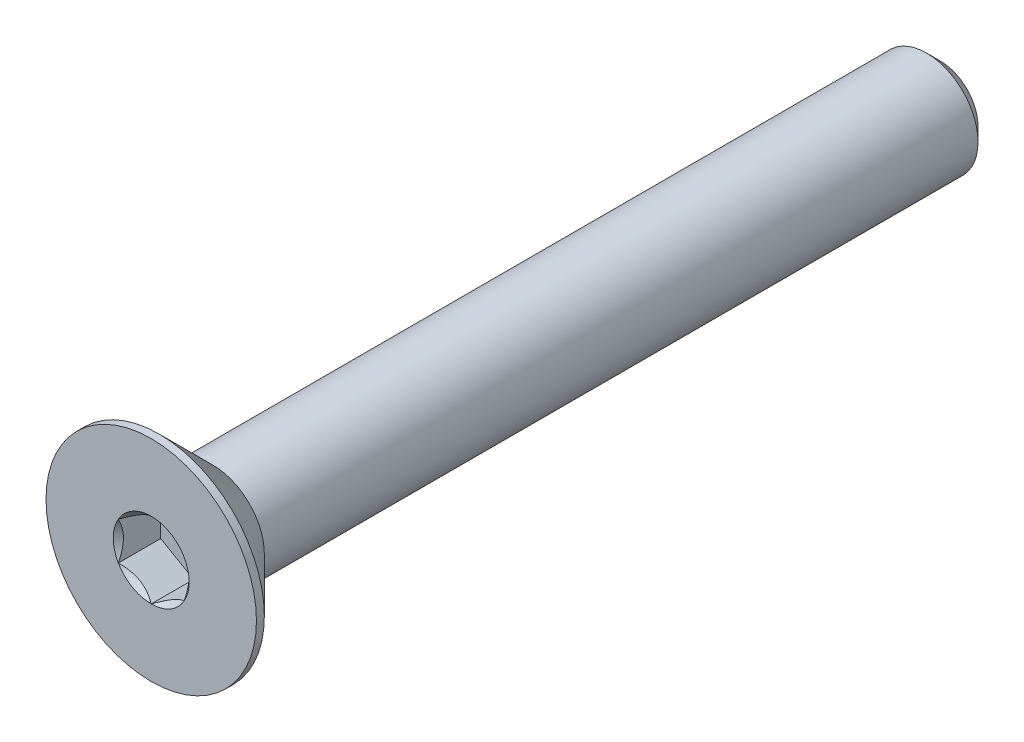
ISO-10303-21;
HEADER;
FILE_DESCRIPTION(('STEP AP214'),'2;1');
FILE_NAME('part.step','',(''),(''),'','','');
FILE_SCHEMA(('AUTOMOTIVE_DESIGN { 1 0 10303 214 1 1 1 1 }'));
ENDSEC;
DATA;
#1=APPLICATION_CONTEXT('core data for automotive mechanical design processes');
#2=APPLICATION_PROTOCOL_DEFINITION('international standard','automotive_design',2000,#1);
#3=PRODUCT_CONTEXT('',#1,'mechanical');
#4=PRODUCT('Part','Part','',(#3));
#5=PRODUCT_RELATED_PRODUCT_CATEGORY('part','',(#4));
#6=PRODUCT_DEFINITION_FORMATION('','',#4);
#7=PRODUCT_DEFINITION_CONTEXT('part definition',#1,'design');
#8=PRODUCT_DEFINITION('design','',#6,#7);
#9=PRODUCT_DEFINITION_SHAPE('','',#8);
#10=(LENGTH_UNIT() NAMED_UNIT(*) SI_UNIT(.MILLI.,.METRE.));
#11=(NAMED_UNIT(*) PLANE_ANGLE_UNIT() SI_UNIT($,.RADIAN.));
#12=(NAMED_UNIT(*) SI_UNIT($,.STERADIAN.) SOLID_ANGLE_UNIT());
#13=UNCERTAINTY_MEASURE_WITH_UNIT(LENGTH_MEASURE(1.E-05),#10,'distance_accuracy_value','');
#14=(GEOMETRIC_REPRESENTATION_CONTEXT(3) GLOBAL_UNCERTAINTY_ASSIGNED_CONTEXT((#13)) GLOBAL_UNIT_ASSIGNED_CONTEXT((#10,
#11,#12)) REPRESENTATION_CONTEXT('',''));
#15=CARTESIAN_POINT('',(0.,0.,0.));
#16=DIRECTION('',(0.,0.,1.));
#17=DIRECTION('',(1.,0.,0.));
#18=AXIS2_PLACEMENT_3D('',#15,#16,#17);
#19=CARTESIAN_POINT('',(1.25,-0.721687836487033,-1.61));
#20=DIRECTION('',(0.,0.,1.));
#21=DIRECTION('',(1.,0.,0.));
#22=AXIS2_PLACEMENT_3D('',#19,#20,#21);
#23=PLANE('',#22);
#24=DIRECTION('',(0.,1.,0.));
#25=VECTOR('',#24,1.);
#26=CARTESIAN_POINT('',(-1.25,0.721687836487033,-1.61));
#27=LINE('',#26,#25);
#28=CARTESIAN_POINT('',(-1.25,0.721687836487032,-1.61));
#29=VERTEX_POINT('',#28);
#30=CARTESIAN_POINT('',(-1.25,-0.721687836487031,-1.61));
#31=VERTEX_POINT('',#30);
#32=EDGE_CURVE('E83',#29,#31,#27,.F.);
#33=ORIENTED_EDGE('',*,*,#32,.T.);
#34=DIRECTION('',(0.866025403784439,-0.5,0.));
#35=VECTOR('',#34,1.);
#36=CARTESIAN_POINT('',(-1.25,-0.721687836487031,-1.61));
#37=LINE('',#36,#35);
#38=CARTESIAN_POINT('',(0.,-1.44337567297406,-1.61));
#39=VERTEX_POINT('',#38);
#40=EDGE_CURVE('E85',#31,#39,#37,.T.);
#41=ORIENTED_EDGE('',*,*,#40,.T.);
#42=DIRECTION('',(0.866025403784439,0.5,0.));
#43=VECTOR('',#42,1.);
#44=CARTESIAN_POINT('',(0.,-1.44337567297406,-1.61));
#45=LINE('',#44,#43);
#46=CARTESIAN_POINT('',(1.25,-0.721687836487033,-1.61));
#47=VERTEX_POINT('',#46);
#48=EDGE_CURVE('E86',#39,#47,#45,.T.);
#49=ORIENTED_EDGE('',*,*,#48,.T.);
#50=DIRECTION('',(0.,1.,0.));
#51=VECTOR('',#50,1.);
#52=CARTESIAN_POINT('',(1.25,-0.721687836487033,-1.61));
#53=LINE('',#52,#51);
#54=CARTESIAN_POINT('',(1.25,0.721687836487033,-1.61));
#55=VERTEX_POINT('',#54);
#56=EDGE_CURVE('E72',#47,#55,#53,.T.);
#57=ORIENTED_EDGE('',*,*,#56,.T.);
#58=DIRECTION('',(-0.866025403784439,0.5,0.));
#59=VECTOR('',#58,1.);
#60=CARTESIAN_POINT('',(1.25,0.721687836487033,-1.61));
#61=LINE('',#60,#59);
#62=CARTESIAN_POINT('',(0.,1.44337567297406,-1.61));
#63=VERTEX_POINT('',#62);
#64=EDGE_CURVE('E111',#55,#63,#61,.T.);
#65=ORIENTED_EDGE('',*,*,#64,.T.);
#66=DIRECTION('',(-0.866025403784439,-0.5,0.));
#67=VECTOR('',#66,1.);
#68=CARTESIAN_POINT('',(0.,1.44337567297406,-1.61));
#69=LINE('',#68,#67);
#70=EDGE_CURVE('E116',#63,#29,#69,.T.);
#71=ORIENTED_EDGE('',*,*,#70,.T.);
#72=EDGE_LOOP('',(#33,#41,#49,#57,#65,#71));
#73=FACE_BOUND('',#72,.T.);
#74=ADVANCED_FACE('F17',(#73),#23,.T.);
#75=CARTESIAN_POINT('',(0.,-1.44337567297406,-1.61));
#76=DIRECTION('',(0.5,-0.866025403784439,0.));
#77=DIRECTION('',(0.866025403784439,0.5,0.));
#78=AXIS2_PLACEMENT_3D('',#75,#76,#77);
#79=PLANE('',#78);
#80=CARTESIAN_POINT('',(-1.59633159146153E-12,-1.44337567297499,-2.268582549399E-12));
#81=CARTESIAN_POINT('',(0.0429631084916685,-1.41857091072118,-0.0247809602853262));
#82=CARTESIAN_POINT('',(0.0866445640224962,-1.39335141061186,-0.048106250542211));
#83=CARTESIAN_POINT('',(0.175715534518587,-1.34192626181896,-0.0908138610995848));
#84=CARTESIAN_POINT('',(0.221113515509129,-1.3157157252734,-0.110172426663462));
#85=CARTESIAN_POINT('',(0.312656311401012,-1.26286346742285,-0.143333784117164));
#86=CARTESIAN_POINT('',(0.358777825771211,-1.23623519868579,-0.15721990325138));
#87=CARTESIAN_POINT('',(0.452035961001519,-1.18239258920645,-0.178614098245694));
#88=CARTESIAN_POINT('',(0.499169734949581,-1.15517989212961,-0.186138138130082));
#89=CARTESIAN_POINT('',(0.580409086338886,-1.1082763307362,-0.192927172266352));
#90=CARTESIAN_POINT('',(0.6144098218632,-1.0886459969286,-0.19393181141306));
#91=CARTESIAN_POINT('',(0.682351445146423,-1.04941988243685,-0.192236504858619));
#92=CARTESIAN_POINT('',(0.716292318027035,-1.02982411034269,-0.189535740825175));
#93=CARTESIAN_POINT('',(0.783846380048843,-0.990821754449551,-0.180585751756811));
#94=CARTESIAN_POINT('',(0.817459234875116,-0.97141536366737,-0.174333227052609));
#95=CARTESIAN_POINT('',(0.884123738991266,-0.932926594270518,-0.158616460881214));
#96=CARTESIAN_POINT('',(0.917175141068937,-0.91384435838388,-0.149150841277129));
#97=CARTESIAN_POINT('',(1.00178642984031,-0.864994008035248,-0.121071668556236));
#98=CARTESIAN_POINT('',(1.05281387539248,-0.835533298609642,-0.100350655055702));
#99=CARTESIAN_POINT('',(1.15287239429478,-0.777764485786684,-0.0536764942537954));
#100=CARTESIAN_POINT('',(1.20190935742265,-0.749452981924566,-0.0277403788128118));
#101=CARTESIAN_POINT('',(1.25000000000159,-0.721687836486111,-2.26874925040989E-12));
#102=B_SPLINE_CURVE_WITH_KNOTS('',3,(#80,#81,#82,#83,#84,#85,#86,#87,#88,#89,#90,#91,#92,#93,
#94,#95,#96,#97,#98,#99,#100,#101),.UNSPECIFIED.,.F.,.F.,(4,2,2,2,2,2,2,2,2,2,4),(0.,
0.166478683193945,0.333926926769032,0.498716658424013,0.663091654503517,0.780745575390526,
0.89842548413854,1.01621489951224,1.13405490022132,1.32111591628309,1.5075756576265),.UNSPECIFIED.);
#103=CARTESIAN_POINT('',(0.,-1.44337567297566,-1.5951974611112E-12));
#104=VERTEX_POINT('',#103);
#105=CARTESIAN_POINT('',(1.2500000000008,-0.721687836489762,-1.13440319504478E-12));
#106=VERTEX_POINT('',#105);
#107=EDGE_CURVE('E20',#104,#106,#102,.T.);
#108=ORIENTED_EDGE('',*,*,#107,.T.);
#109=DIRECTION('',(0.,0.,1.));
#110=VECTOR('',#109,1.);
#111=CARTESIAN_POINT('',(1.25,-0.721687836487033,-1.61));
#112=LINE('',#111,#110);
#113=EDGE_CURVE('E91',#106,#47,#112,.F.);
#114=ORIENTED_EDGE('',*,*,#113,.T.);
#115=ORIENTED_EDGE('',*,*,#48,.F.);
#116=DIRECTION('',(0.,0.,1.));
#117=VECTOR('',#116,1.);
#118=CARTESIAN_POINT('',(0.,-1.44337567297406,-1.61));
#119=LINE('',#118,#117);
#120=EDGE_CURVE('E59',#39,#104,#119,.T.);
#121=ORIENTED_EDGE('',*,*,#120,.T.);
#122=EDGE_LOOP('',(#108,#114,#115,#121));
#123=FACE_BOUND('',#122,.T.);
#124=ADVANCED_FACE('F90',(#123),#79,.F.);
#125=CARTESIAN_POINT('',(-1.25,-0.721687836487031,-1.61));
#126=DIRECTION('',(-0.5,-0.866025403784439,0.));
#127=DIRECTION('',(0.866025403784439,-0.5,0.));
#128=AXIS2_PLACEMENT_3D('',#125,#126,#127);
#129=PLANE('',#128);
#130=CARTESIAN_POINT('',(-1.2500000000016,-0.721687836486109,-2.26772727717919E-12));
#131=CARTESIAN_POINT('',(-1.20703689150833,-0.746492598739919,-0.0247809602853254));
#132=CARTESIAN_POINT('',(-1.1633554359775,-0.771712098849237,-0.0481062505422104));
#133=CARTESIAN_POINT('',(-1.07428446548141,-0.823137247642137,-0.0908138610995846));
#134=CARTESIAN_POINT('',(-1.02888648449087,-0.849347784187692,-0.110172426663462));
#135=CARTESIAN_POINT('',(-0.937343688598988,-0.902200042038241,-0.143333784117165));
#136=CARTESIAN_POINT('',(-0.891222174228788,-0.928828310775309,-0.15721990325138));
#137=CARTESIAN_POINT('',(-0.79796403899848,-0.98267092025465,-0.178614098245695));
#138=CARTESIAN_POINT('',(-0.750830265050418,-1.00988361733149,-0.186138138130082));
#139=CARTESIAN_POINT('',(-0.669590913661113,-1.05678717872489,-0.192927172266352));
#140=CARTESIAN_POINT('',(-0.635590178136799,-1.0764175125325,-0.193931811413061));
#141=CARTESIAN_POINT('',(-0.567648554853576,-1.11564362702425,-0.192236504858619));
#142=CARTESIAN_POINT('',(-0.533707681972964,-1.1352393991184,-0.189535740825175));
#143=CARTESIAN_POINT('',(-0.466153619951155,-1.17424175501155,-0.180585751756811));
#144=CARTESIAN_POINT('',(-0.432540765124883,-1.19364814579373,-0.174333227052609));
#145=CARTESIAN_POINT('',(-0.365876261008733,-1.23213691519058,-0.158616460881214));
#146=CARTESIAN_POINT('',(-0.332824858931062,-1.25121915107722,-0.149150841277129));
#147=CARTESIAN_POINT('',(-0.248213570159689,-1.30006950142585,-0.121071668556236));
#148=CARTESIAN_POINT('',(-0.197186124607517,-1.32953021085146,-0.100350655055702));
#149=CARTESIAN_POINT('',(-0.0971276057052169,-1.38729902367441,-0.0536764942537953));
#150=CARTESIAN_POINT('',(-0.0480906425773456,-1.41561052753653,-0.0277403788128117));
#151=CARTESIAN_POINT('',(1.59649182397064E-12,-1.44337567297499,-2.26862875383583E-12));
#152=B_SPLINE_CURVE_WITH_KNOTS('',3,(#130,#131,#132,#133,#134,#135,#136,#137,#138,#139,#140,
#141,#142,#143,#144,#145,#146,#147,#148,#149,#150,#151),.UNSPECIFIED.,.F.,.F.,(4,2,2,2,2,2,2,2,
2,2,4),(0.,0.166478683193946,0.333926926769033,0.498716658424015,0.66309165450352,
0.780745575390529,0.898425484138542,1.01621489951224,1.13405490022132,1.3211159162831,
1.5075756576265),.UNSPECIFIED.);
#153=CARTESIAN_POINT('',(-1.25000000000138,-0.721687836487828,-1.59464569232191E-12));
#154=VERTEX_POINT('',#153);
#155=EDGE_CURVE('E95',#154,#104,#152,.T.);
#156=ORIENTED_EDGE('',*,*,#155,.T.);
#157=ORIENTED_EDGE('',*,*,#120,.F.);
#158=ORIENTED_EDGE('',*,*,#40,.F.);
#159=DIRECTION('',(0.,0.,1.));
#160=VECTOR('',#159,1.);
#161=CARTESIAN_POINT('',(-1.25,-0.721687836487031,-1.61));
#162=LINE('',#161,#160);
#163=EDGE_CURVE('E97',#31,#154,#162,.T.);
#164=ORIENTED_EDGE('',*,*,#163,.T.);
#165=EDGE_LOOP('',(#156,#157,#158,#164));
#166=FACE_BOUND('',#165,.T.);
#167=ADVANCED_FACE('F93',(#166),#129,.F.);
#168=CARTESIAN_POINT('',(-1.25,0.721687836487033,-1.61));
#169=DIRECTION('',(-1.,0.,0.));
#170=DIRECTION('',(0.,0.,1.));
#171=AXIS2_PLACEMENT_3D('',#168,#169,#170);
#172=PLANE('',#171);
#173=CARTESIAN_POINT('',(-1.25,0.721687836488875,-2.26707172904113E-12));
#174=CARTESIAN_POINT('',(-1.25,0.672078311968734,-0.0247809602843515));
#175=CARTESIAN_POINT('',(-1.25,0.621639311737501,-0.0481062505397474));
#176=CARTESIAN_POINT('',(-1.25,0.518789014126518,-0.0908138610927559));
#177=CARTESIAN_POINT('',(-1.25,0.466367941022824,-0.110172426653753));
#178=CARTESIAN_POINT('',(-1.25,0.360663425297221,-0.143333784099995));
#179=CARTESIAN_POINT('',(-1.25,0.307406887811172,-0.157219903229681));
#180=CARTESIAN_POINT('',(-1.25,0.199721668829271,-0.178614098213361));
#181=CARTESIAN_POINT('',(-1.25,0.145296274664291,-0.186138138091645));
#182=CARTESIAN_POINT('',(-1.25,0.0514891518512712,-0.192927172217058));
#183=CARTESIAN_POINT('',(-1.25,0.0122284842208852,-0.19393181135857));
#184=CARTESIAN_POINT('',(-1.25,-0.0662237447923836,-0.19223650479206));
#185=CARTESIAN_POINT('',(-1.25,-0.10541528899529,-0.189535740751741));
#186=CARTESIAN_POINT('',(-1.25,-0.183420000810115,-0.180585751668415));
#187=CARTESIAN_POINT('',(-1.25,-0.222232782388411,-0.174333226956124));
#188=CARTESIAN_POINT('',(-1.25,-0.299210321209361,-0.158616460767832));
#189=CARTESIAN_POINT('',(-1.25,-0.337374792995946,-0.14915084115494));
#190=CARTESIAN_POINT('',(-1.25,-0.43507549364919,-0.121071668433227));
#191=CARTESIAN_POINT('',(-1.25,-0.493996912445358,-0.100350654949517));
#192=CARTESIAN_POINT('',(-1.25,-0.609534537985813,-0.0536764941931683));
#193=CARTESIAN_POINT('',(-1.25,-0.66615754565963,-0.0277403787809137));
#194=CARTESIAN_POINT('',(-1.25,-0.721687836488873,-2.26787846144495E-12));
#195=B_SPLINE_CURVE_WITH_KNOTS('',3,(#173,#174,#175,#176,#177,#178,#179,#180,#181,#182,#183,
#184,#185,#186,#187,#188,#189,#190,#191,#192,#193,#194),.UNSPECIFIED.,.F.,.F.,(4,2,2,2,2,2,2,2,
2,2,4),(0.,0.166478683226287,0.333926926833723,0.498716658519756,0.663091654630285,
0.780745575562284,0.89842548435534,1.01621489977414,1.13405490052833,1.3211159164188,
1.50757565759031),.UNSPECIFIED.);
#196=CARTESIAN_POINT('',(-1.25000000000138,0.72168783648783,-1.59446391689966E-12));
#197=VERTEX_POINT('',#196);
#198=EDGE_CURVE('E195',#197,#154,#195,.T.);
#199=ORIENTED_EDGE('',*,*,#198,.T.);
#200=ORIENTED_EDGE('',*,*,#163,.F.);
#201=ORIENTED_EDGE('',*,*,#32,.F.);
#202=DIRECTION('',(0.,0.,1.));
#203=VECTOR('',#202,1.);
#204=CARTESIAN_POINT('',(-1.25,0.721687836487032,-1.61));
#205=LINE('',#204,#203);
#206=EDGE_CURVE('E113',#29,#197,#205,.T.);
#207=ORIENTED_EDGE('',*,*,#206,.T.);
#208=EDGE_LOOP('',(#199,#200,#201,#207));
#209=FACE_BOUND('',#208,.T.);
#210=ADVANCED_FACE('F205',(#209),#172,.F.);
#211=CARTESIAN_POINT('',(0.,1.44337567297406,-1.61));
#212=DIRECTION('',(-0.5,0.866025403784439,0.));
#213=DIRECTION('',(-0.866025403784439,-0.5,0.));
#214=AXIS2_PLACEMENT_3D('',#211,#212,#213);
#215=PLANE('',#214);
#216=CARTESIAN_POINT('',(1.59613349239709E-12,1.44337567297499,-2.2683395990387E-12));
#217=CARTESIAN_POINT('',(-0.0429631084916687,1.41857091072118,-0.024780960285326));
#218=CARTESIAN_POINT('',(-0.0866445640224964,1.39335141061186,-0.0481062505422108));
#219=CARTESIAN_POINT('',(-0.175715534518587,1.34192626181896,-0.0908138610995847));
#220=CARTESIAN_POINT('',(-0.22111351550913,1.3157157252734,-0.110172426663462));
#221=CARTESIAN_POINT('',(-0.312656311401012,1.26286346742285,-0.143333784117164));
#222=CARTESIAN_POINT('',(-0.358777825771212,1.23623519868579,-0.15721990325138));
#223=CARTESIAN_POINT('',(-0.45203596100152,1.18239258920645,-0.178614098245694));
#224=CARTESIAN_POINT('',(-0.499169734949581,1.15517989212961,-0.186138138130082));
#225=CARTESIAN_POINT('',(-0.580409086338886,1.1082763307362,-0.192927172266352));
#226=CARTESIAN_POINT('',(-0.6144098218632,1.0886459969286,-0.19393181141306));
#227=CARTESIAN_POINT('',(-0.682351445146423,1.04941988243685,-0.192236504858619));
#228=CARTESIAN_POINT('',(-0.716292318027036,1.02982411034269,-0.189535740825175));
#229=CARTESIAN_POINT('',(-0.783846380048844,0.99082175444955,-0.180585751756811));
#230=CARTESIAN_POINT('',(-0.817459234875117,0.97141536366737,-0.174333227052609));
#231=CARTESIAN_POINT('',(-0.884123738991267,0.932926594270518,-0.158616460881213));
#232=CARTESIAN_POINT('',(-0.917175141068938,0.91384435838388,-0.149150841277128));
#233=CARTESIAN_POINT('',(-1.00178642984031,0.864994008035247,-0.121071668556235));
#234=CARTESIAN_POINT('',(-1.05281387539248,0.835533298609641,-0.100350655055701));
#235=CARTESIAN_POINT('',(-1.15287239429478,0.777764485786683,-0.0536764942537944));
#236=CARTESIAN_POINT('',(-1.20190935742265,0.749452981924565,-0.0277403788128108));
#237=CARTESIAN_POINT('',(-1.2500000000016,0.721687836486111,-2.26788103424833E-12));
#238=B_SPLINE_CURVE_WITH_KNOTS('',3,(#216,#217,#218,#219,#220,#221,#222,#223,#224,#225,#226,
#227,#228,#229,#230,#231,#232,#233,#234,#235,#236,#237),.UNSPECIFIED.,.F.,.F.,(4,2,2,2,2,2,2,2,
2,2,4),(0.,0.166478683193945,0.333926926769032,0.498716658424013,0.663091654503518,
0.780745575390527,0.898425484138541,1.01621489951224,1.13405490022132,1.3211159162831,
1.5075756576265),.UNSPECIFIED.);
#239=CARTESIAN_POINT('',(0.,1.44337567297566,-1.59483068508603E-12));
#240=VERTEX_POINT('',#239);
#241=EDGE_CURVE('E187',#240,#197,#238,.T.);
#242=ORIENTED_EDGE('',*,*,#241,.T.);
#243=ORIENTED_EDGE('',*,*,#206,.F.);
#244=ORIENTED_EDGE('',*,*,#70,.F.);
#245=DIRECTION('',(0.,0.,1.));
#246=VECTOR('',#245,1.);
#247=CARTESIAN_POINT('',(0.,1.44337567297406,-1.61));
#248=LINE('',#247,#246);
#249=EDGE_CURVE('E108',#63,#240,#248,.T.);
#250=ORIENTED_EDGE('',*,*,#249,.T.);
#251=EDGE_LOOP('',(#242,#243,#244,#250));
#252=FACE_BOUND('',#251,.T.);
#253=ADVANCED_FACE('F201',(#252),#215,.F.);
#254=CARTESIAN_POINT('',(1.25,0.721687836487033,-1.61));
#255=DIRECTION('',(0.5,0.866025403784439,0.));
#256=DIRECTION('',(-0.866025403784439,0.5,0.));
#257=AXIS2_PLACEMENT_3D('',#254,#255,#256);
#258=PLANE('',#257);
#259=CARTESIAN_POINT('',(1.2500000000016,0.721687836486112,-2.26853678419014E-12));
#260=CARTESIAN_POINT('',(1.20703689150833,0.746492598739921,-0.0247809602853261));
#261=CARTESIAN_POINT('',(1.1633554359775,0.771712098849239,-0.0481062505422108));
#262=CARTESIAN_POINT('',(1.07428446548141,0.823137247642138,-0.0908138610995846));
#263=CARTESIAN_POINT('',(1.02888648449087,0.849347784187693,-0.110172426663462));
#264=CARTESIAN_POINT('',(0.937343688598987,0.902200042038243,-0.143333784117164));
#265=CARTESIAN_POINT('',(0.891222174228788,0.92882831077531,-0.15721990325138));
#266=CARTESIAN_POINT('',(0.79796403899848,0.982670920254651,-0.178614098245694));
#267=CARTESIAN_POINT('',(0.750830265050419,1.00988361733149,-0.186138138130081));
#268=CARTESIAN_POINT('',(0.669590913661114,1.05678717872489,-0.192927172266351));
#269=CARTESIAN_POINT('',(0.6355901781368,1.0764175125325,-0.19393181141306));
#270=CARTESIAN_POINT('',(0.567648554853577,1.11564362702425,-0.192236504858619));
#271=CARTESIAN_POINT('',(0.533707681972964,1.1352393991184,-0.189535740825174));
#272=CARTESIAN_POINT('',(0.466153619951156,1.17424175501155,-0.180585751756811));
#273=CARTESIAN_POINT('',(0.432540765124883,1.19364814579373,-0.174333227052609));
#274=CARTESIAN_POINT('',(0.365876261008733,1.23213691519058,-0.158616460881213));
#275=CARTESIAN_POINT('',(0.332824858931062,1.25121915107722,-0.149150841277128));
#276=CARTESIAN_POINT('',(0.24821357015969,1.30006950142585,-0.121071668556235));
#277=CARTESIAN_POINT('',(0.197186124607517,1.32953021085146,-0.100350655055702));
#278=CARTESIAN_POINT('',(0.0971276057052174,1.38729902367441,-0.0536764942537946));
#279=CARTESIAN_POINT('',(0.0480906425773461,1.41561052753653,-0.0277403788128111));
#280=CARTESIAN_POINT('',(-1.59614565415006E-12,1.44337567297499,-2.26815881940463E-12));
#281=B_SPLINE_CURVE_WITH_KNOTS('',3,(#259,#260,#261,#262,#263,#264,#265,#266,#267,#268,#269,
#270,#271,#272,#273,#274,#275,#276,#277,#278,#279,#280),.UNSPECIFIED.,.F.,.F.,(4,2,2,2,2,2,2,2,
2,2,4),(0.,0.166478683193945,0.333926926769031,0.498716658424013,0.663091654503516,
0.780745575390525,0.898425484138539,1.01621489951224,1.13405490022132,1.32111591628309,
1.5075756576265),.UNSPECIFIED.);
#282=CARTESIAN_POINT('',(1.25000000000138,0.721687836487831,-1.59505075853978E-12));
#283=VERTEX_POINT('',#282);
#284=EDGE_CURVE('E157',#283,#240,#281,.T.);
#285=ORIENTED_EDGE('',*,*,#284,.T.);
#286=ORIENTED_EDGE('',*,*,#249,.F.);
#287=ORIENTED_EDGE('',*,*,#64,.F.);
#288=DIRECTION('',(0.,0.,1.));
#289=VECTOR('',#288,1.);
#290=CARTESIAN_POINT('',(1.25,0.721687836487033,-1.61));
#291=LINE('',#290,#289);
#292=EDGE_CURVE('E40',#55,#283,#291,.T.);
#293=ORIENTED_EDGE('',*,*,#292,.T.);
#294=EDGE_LOOP('',(#285,#286,#287,#293));
#295=FACE_BOUND('',#294,.T.);
#296=ADVANCED_FACE('F204',(#295),#258,.F.);
#297=CARTESIAN_POINT('',(1.25,-0.721687836487033,-1.61));
#298=DIRECTION('',(1.,0.,0.));
#299=DIRECTION('',(0.,1.,0.));
#300=AXIS2_PLACEMENT_3D('',#297,#298,#299);
#301=PLANE('',#300);
#302=CARTESIAN_POINT('',(1.25,-0.721687836488877,-2.26868277257188E-12));
#303=CARTESIAN_POINT('',(1.25,-0.672078311968736,-0.0247809602843532));
#304=CARTESIAN_POINT('',(1.25,-0.621639311737502,-0.0481062505397492));
#305=CARTESIAN_POINT('',(1.25,-0.51878901412652,-0.0908138610927579));
#306=CARTESIAN_POINT('',(1.25,-0.466367941022825,-0.110172426653756));
#307=CARTESIAN_POINT('',(1.25,-0.360663425297223,-0.143333784099998));
#308=CARTESIAN_POINT('',(1.25,-0.307406887811173,-0.157219903229684));
#309=CARTESIAN_POINT('',(1.25,-0.199721668829271,-0.178614098213363));
#310=CARTESIAN_POINT('',(1.25,-0.145296274664292,-0.186138138091648));
#311=CARTESIAN_POINT('',(1.25,-0.0514891518512717,-0.19292717221706));
#312=CARTESIAN_POINT('',(1.25,-0.0122284842208858,-0.193931811358573));
#313=CARTESIAN_POINT('',(1.25,0.0662237447923829,-0.192236504792063));
#314=CARTESIAN_POINT('',(1.25,0.105415288995289,-0.189535740751744));
#315=CARTESIAN_POINT('',(1.25,0.183420000810114,-0.180585751668418));
#316=CARTESIAN_POINT('',(1.25,0.22223278238841,-0.174333226956126));
#317=CARTESIAN_POINT('',(1.25,0.299210321209359,-0.158616460767835));
#318=CARTESIAN_POINT('',(1.25,0.337374792995945,-0.149150841154943));
#319=CARTESIAN_POINT('',(1.25,0.43507549364919,-0.121071668433229));
#320=CARTESIAN_POINT('',(1.25,0.493996912445358,-0.100350654949519));
#321=CARTESIAN_POINT('',(1.25,0.609534537985814,-0.0536764941931697));
#322=CARTESIAN_POINT('',(1.25,0.666157545659632,-0.0277403787809148));
#323=CARTESIAN_POINT('',(1.25,0.721687836488876,-2.26852812832509E-12));
#324=B_SPLINE_CURVE_WITH_KNOTS('',3,(#302,#303,#304,#305,#306,#307,#308,#309,#310,#311,#312,
#313,#314,#315,#316,#317,#318,#319,#320,#321,#322,#323),.UNSPECIFIED.,.F.,.F.,(4,2,2,2,2,2,2,2,
2,2,4),(0.,0.166478683226287,0.333926926833724,0.498716658519757,0.663091654630287,
0.780745575562285,0.898425484355342,1.01621489977414,1.13405490052833,1.3211159164188,
1.50757565759032),.UNSPECIFIED.);
#325=EDGE_CURVE('E149',#106,#283,#324,.T.);
#326=ORIENTED_EDGE('',*,*,#325,.T.);
#327=ORIENTED_EDGE('',*,*,#292,.F.);
#328=ORIENTED_EDGE('',*,*,#56,.F.);
#329=ORIENTED_EDGE('',*,*,#113,.F.);
#330=EDGE_LOOP('',(#326,#327,#328,#329));
#331=FACE_BOUND('',#330,.T.);
#332=ADVANCED_FACE('F165',(#331),#301,.F.);
#333=CARTESIAN_POINT('',(0.,0.,-5.6843418860808E-11));
#334=DIRECTION('',(0.,0.,1.));
#335=DIRECTION('',(1.,0.,0.));
#336=AXIS2_PLACEMENT_3D('',#333,#334,#335);
#337=CONICAL_SURFACE('',#336,1.44337567292041,0.78539816325135);
#338=ORIENTED_EDGE('',*,*,#107,.F.);
#339=CARTESIAN_POINT('',(0.,0.,0.));
#340=DIRECTION('',(0.,0.,1.));
#341=DIRECTION('',(1.,0.,0.));
#342=AXIS2_PLACEMENT_3D('',#339,#340,#341);
#343=CIRCLE('',#342,1.44337567297725);
#344=EDGE_CURVE('E146',#106,#104,#343,.F.);
#345=ORIENTED_EDGE('',*,*,#344,.F.);
#346=EDGE_LOOP('',(#338,#345));
#347=FACE_BOUND('',#346,.T.);
#348=ADVANCED_FACE('F222',(#347),#337,.F.);
#349=CARTESIAN_POINT('',(0.,0.,-5.6843418860808E-11));
#350=DIRECTION('',(0.,0.,1.));
#351=DIRECTION('',(1.,0.,0.));
#352=AXIS2_PLACEMENT_3D('',#349,#350,#351);
#353=CONICAL_SURFACE('',#352,1.44337567292041,0.78539816325135);
#354=ORIENTED_EDGE('',*,*,#155,.F.);
#355=CARTESIAN_POINT('',(0.,0.,0.));
#356=DIRECTION('',(0.,0.,1.));
#357=DIRECTION('',(1.,0.,0.));
#358=AXIS2_PLACEMENT_3D('',#355,#356,#357);
#359=CIRCLE('',#358,1.44337567297725);
#360=EDGE_CURVE('E143',#104,#154,#359,.F.);
#361=ORIENTED_EDGE('',*,*,#360,.F.);
#362=EDGE_LOOP('',(#354,#361));
#363=FACE_BOUND('',#362,.T.);
#364=ADVANCED_FACE('F219',(#363),#353,.F.);
#365=CARTESIAN_POINT('',(0.,0.,-5.6843418860808E-11));
#366=DIRECTION('',(0.,0.,1.));
#367=DIRECTION('',(1.,0.,0.));
#368=AXIS2_PLACEMENT_3D('',#365,#366,#367);
#369=CONICAL_SURFACE('',#368,1.44337567292041,0.785398163397448);
#370=ORIENTED_EDGE('',*,*,#198,.F.);
#371=CARTESIAN_POINT('',(0.,0.,0.));
#372=DIRECTION('',(0.,0.,1.));
#373=DIRECTION('',(1.,0.,0.));
#374=AXIS2_PLACEMENT_3D('',#371,#372,#373);
#375=CIRCLE('',#374,1.44337567297725);
#376=EDGE_CURVE('E140',#154,#197,#375,.F.);
#377=ORIENTED_EDGE('',*,*,#376,.F.);
#378=EDGE_LOOP('',(#370,#377));
#379=FACE_BOUND('',#378,.T.);
#380=ADVANCED_FACE('F183',(#379),#369,.F.);
#381=CARTESIAN_POINT('',(0.,0.,-5.6843418860808E-11));
#382=DIRECTION('',(0.,0.,1.));
#383=DIRECTION('',(1.,0.,0.));
#384=AXIS2_PLACEMENT_3D('',#381,#382,#383);
#385=CONICAL_SURFACE('',#384,1.44337567292041,0.78539816325135);
#386=ORIENTED_EDGE('',*,*,#241,.F.);
#387=CARTESIAN_POINT('',(0.,0.,0.));
#388=DIRECTION('',(0.,0.,1.));
#389=DIRECTION('',(1.,0.,0.));
#390=AXIS2_PLACEMENT_3D('',#387,#388,#389);
#391=CIRCLE('',#390,1.44337567297725);
#392=EDGE_CURVE('E137',#197,#240,#391,.F.);
#393=ORIENTED_EDGE('',*,*,#392,.F.);
#394=EDGE_LOOP('',(#386,#393));
#395=FACE_BOUND('',#394,.T.);
#396=ADVANCED_FACE('F178',(#395),#385,.F.);
#397=CARTESIAN_POINT('',(0.,0.,-5.6843418860808E-11));
#398=DIRECTION('',(0.,0.,1.));
#399=DIRECTION('',(1.,0.,0.));
#400=AXIS2_PLACEMENT_3D('',#397,#398,#399);
#401=CONICAL_SURFACE('',#400,1.44337567292041,0.78539816325135);
#402=ORIENTED_EDGE('',*,*,#284,.F.);
#403=CARTESIAN_POINT('',(0.,0.,0.));
#404=DIRECTION('',(0.,0.,1.));
#405=DIRECTION('',(1.,0.,0.));
#406=AXIS2_PLACEMENT_3D('',#403,#404,#405);
#407=CIRCLE('',#406,1.44337567297725);
#408=EDGE_CURVE('E134',#240,#283,#407,.F.);
#409=ORIENTED_EDGE('',*,*,#408,.F.);
#410=EDGE_LOOP('',(#402,#409));
#411=FACE_BOUND('',#410,.T.);
#412=ADVANCED_FACE('F172',(#411),#401,.F.);
#413=CARTESIAN_POINT('',(0.,0.,-5.6843418860808E-11));
#414=DIRECTION('',(0.,0.,1.));
#415=DIRECTION('',(1.,0.,0.));
#416=AXIS2_PLACEMENT_3D('',#413,#414,#415);
#417=CONICAL_SURFACE('',#416,1.44337567292041,0.785398163397448);
#418=CARTESIAN_POINT('',(0.,0.,0.));
#419=DIRECTION('',(0.,0.,1.));
#420=DIRECTION('',(1.,0.,0.));
#421=AXIS2_PLACEMENT_3D('',#418,#419,#420);
#422=CIRCLE('',#421,1.44337567297725);
#423=EDGE_CURVE('E131',#283,#106,#422,.F.);
#424=ORIENTED_EDGE('',*,*,#423,.F.);
#425=ORIENTED_EDGE('',*,*,#325,.F.);
#426=EDGE_LOOP('',(#424,#425));
#427=FACE_BOUND('',#426,.T.);
#428=ADVANCED_FACE('F167',(#427),#417,.F.);
#429=CARTESIAN_POINT('',(0.,-2.,0.));
#430=DIRECTION('',(0.,0.,1.));
#431=DIRECTION('',(0.,-1.,0.));
#432=AXIS2_PLACEMENT_3D('',#429,#430,#431);
#433=PLANE('',#432);
#434=ORIENTED_EDGE('',*,*,#408,.T.);
#435=ORIENTED_EDGE('',*,*,#423,.T.);
#436=ORIENTED_EDGE('',*,*,#344,.T.);
#437=ORIENTED_EDGE('',*,*,#360,.T.);
#438=ORIENTED_EDGE('',*,*,#376,.T.);
#439=ORIENTED_EDGE('',*,*,#392,.T.);
#440=EDGE_LOOP('',(#434,#435,#436,#437,#438,#439));
#441=FACE_BOUND('',#440,.T.);
#442=CARTESIAN_POINT('',(0.,0.,0.));
#443=DIRECTION('',(0.,0.,1.));
#444=DIRECTION('',(0.,-1.,0.));
#445=AXIS2_PLACEMENT_3D('',#442,#443,#444);
#446=CIRCLE('',#445,4.);
#447=CARTESIAN_POINT('',(0.,-4.,0.));
#448=VERTEX_POINT('',#447);
#449=EDGE_CURVE('E128',#448,#448,#446,.F.);
#450=ORIENTED_EDGE('',*,*,#449,.F.);
#451=EDGE_LOOP('',(#450));
#452=FACE_BOUND('',#451,.T.);
#453=ADVANCED_FACE('F171',(#441,#452),#433,.T.);
#454=CARTESIAN_POINT('',(0.,-2.,-29.9999999999999));
#455=DIRECTION('',(0.,0.,-1.));
#456=DIRECTION('',(0.,1.,0.));
#457=AXIS2_PLACEMENT_3D('',#454,#455,#456);
#458=PLANE('',#457);
#459=CARTESIAN_POINT('',(0.,0.,-30.0000000000296));
#460=DIRECTION('',(0.,0.,1.));
#461=DIRECTION('',(1.,0.,0.));
#462=AXIS2_PLACEMENT_3D('',#459,#460,#461);
#463=CIRCLE('',#462,1.42899999997326);
#464=CARTESIAN_POINT('',(1.42899999997326,0.,-30.0000000000296));
#465=VERTEX_POINT('',#464);
#466=EDGE_CURVE('E124',#465,#465,#463,.T.);
#467=ORIENTED_EDGE('',*,*,#466,.F.);
#468=EDGE_LOOP('',(#467));
#469=FACE_BOUND('',#468,.T.);
#470=ADVANCED_FACE('F250',(#469),#458,.T.);
#471=CARTESIAN_POINT('',(0.,0.,0.));
#472=DIRECTION('',(0.,0.,1.));
#473=DIRECTION('',(0.,-1.,0.));
#474=AXIS2_PLACEMENT_3D('',#471,#472,#473);
#475=CYLINDRICAL_SURFACE('',#474,4.);
#476=CARTESIAN_POINT('',(0.,0.,-0.299999999981541));
#477=DIRECTION('',(0.,0.,1.));
#478=DIRECTION('',(0.,-1.,0.));
#479=AXIS2_PLACEMENT_3D('',#476,#477,#478);
#480=CIRCLE('',#479,4.0000000000191);
#481=CARTESIAN_POINT('',(0.,-4.0000000000191,-0.299999999981537));
#482=VERTEX_POINT('',#481);
#483=EDGE_CURVE('E127',#482,#482,#480,.F.);
#484=ORIENTED_EDGE('',*,*,#483,.F.);
#485=EDGE_LOOP('',(#484));
#486=FACE_BOUND('',#485,.T.);
#487=ORIENTED_EDGE('',*,*,#449,.T.);
#488=EDGE_LOOP('',(#487));
#489=FACE_BOUND('',#488,.T.);
#490=ADVANCED_FACE('F247',(#486,#489),#475,.T.);
#491=CARTESIAN_POINT('',(0.,0.,-29.4750000000477));
#492=DIRECTION('',(0.,0.,1.));
#493=DIRECTION('',(1.,0.,0.));
#494=AXIS2_PLACEMENT_3D('',#491,#492,#493);
#495=CONICAL_SURFACE('',#494,1.95399999995516,0.785398163397448);
#496=ORIENTED_EDGE('',*,*,#466,.T.);
#497=EDGE_LOOP('',(#496));
#498=FACE_BOUND('',#497,.T.);
#499=CARTESIAN_POINT('',(0.,0.,-29.475));
#500=DIRECTION('',(0.,0.,-1.));
#501=DIRECTION('',(0.,1.,0.));
#502=AXIS2_PLACEMENT_3D('',#499,#500,#501);
#503=CIRCLE('',#502,1.954);
#504=CARTESIAN_POINT('',(0.,1.954,-29.475));
#505=VERTEX_POINT('',#504);
#506=EDGE_CURVE('E31',#505,#505,#503,.F.);
#507=ORIENTED_EDGE('',*,*,#506,.F.);
#508=EDGE_LOOP('',(#507));
#509=FACE_BOUND('',#508,.T.);
#510=ADVANCED_FACE('F240',(#498,#509),#495,.T.);
#511=CARTESIAN_POINT('',(0.,0.,-0.299999999924697));
#512=DIRECTION('',(0.,0.,1.));
#513=DIRECTION('',(0.,-1.,0.));
#514=AXIS2_PLACEMENT_3D('',#511,#512,#513);
#515=CONICAL_SURFACE('',#514,4.00000000007594,0.785398163397449);
#516=CARTESIAN_POINT('',(0.,0.,-2.346));
#517=DIRECTION('',(0.,0.,-1.));
#518=DIRECTION('',(0.,1.,0.));
#519=AXIS2_PLACEMENT_3D('',#516,#517,#518);
#520=CIRCLE('',#519,1.954);
#521=CARTESIAN_POINT('',(0.,1.954,-2.346));
#522=VERTEX_POINT('',#521);
#523=EDGE_CURVE('E11',#522,#522,#520,.T.);
#524=ORIENTED_EDGE('',*,*,#523,.F.);
#525=EDGE_LOOP('',(#524));
#526=FACE_BOUND('',#525,.T.);
#527=ORIENTED_EDGE('',*,*,#483,.T.);
#528=EDGE_LOOP('',(#527));
#529=FACE_BOUND('',#528,.T.);
#530=ADVANCED_FACE('F234',(#526,#529),#515,.T.);
#531=CARTESIAN_POINT('',(0.,0.,-29.9999999999999));
#532=DIRECTION('',(0.,0.,-1.));
#533=DIRECTION('',(0.,1.,0.));
#534=AXIS2_PLACEMENT_3D('',#531,#532,#533);
#535=CYLINDRICAL_SURFACE('',#534,1.954);
#536=ORIENTED_EDGE('',*,*,#523,.T.);
#537=EDGE_LOOP('',(#536));
#538=FACE_BOUND('',#537,.T.);
#539=ORIENTED_EDGE('',*,*,#506,.T.);
#540=EDGE_LOOP('',(#539));
#541=FACE_BOUND('',#540,.T.);
#542=ADVANCED_FACE('F232',(#538,#541),#535,.T.);
#543=CLOSED_SHELL('',(#74,#124,#167,#210,#253,#296,#332,#348,#364,#380,#396,#412,#428,#453,#470,
#490,#510,#530,#542));
#544=MANIFOLD_SOLID_BREP('B1',#543);
#545=ADVANCED_BREP_SHAPE_REPRESENTATION('',(#18,#544),#14);
#546=SHAPE_DEFINITION_REPRESENTATION(#9,#545);
ENDSEC;
END-ISO-10303-21;
